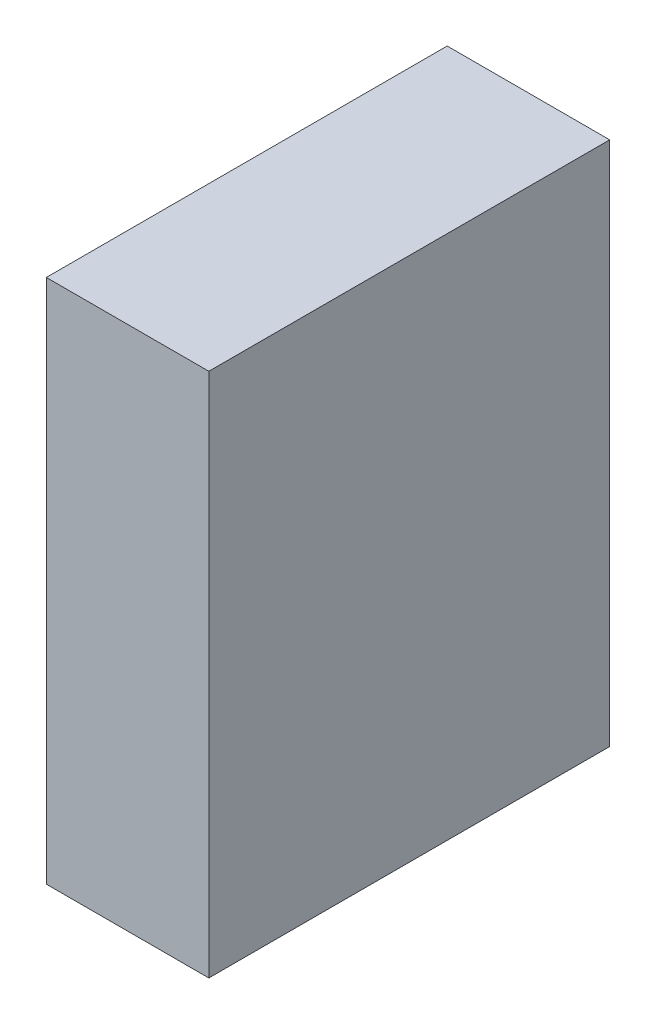
ISO-10303-21;
HEADER;
FILE_DESCRIPTION(('STEP AP214'),'2;1');
FILE_NAME('part.step','',(''),(''),'','','');
FILE_SCHEMA(('AUTOMOTIVE_DESIGN { 1 0 10303 214 1 1 1 1 }'));
ENDSEC;
DATA;
#1=APPLICATION_CONTEXT('core data for automotive mechanical design processes');
#2=APPLICATION_PROTOCOL_DEFINITION('international standard','automotive_design',2000,#1);
#3=PRODUCT_CONTEXT('',#1,'mechanical');
#4=PRODUCT('Part','Part','',(#3));
#5=PRODUCT_RELATED_PRODUCT_CATEGORY('part','',(#4));
#6=PRODUCT_DEFINITION_FORMATION('','',#4);
#7=PRODUCT_DEFINITION_CONTEXT('part definition',#1,'design');
#8=PRODUCT_DEFINITION('design','',#6,#7);
#9=PRODUCT_DEFINITION_SHAPE('','',#8);
#10=(LENGTH_UNIT() NAMED_UNIT(*) SI_UNIT(.MILLI.,.METRE.));
#11=(NAMED_UNIT(*) PLANE_ANGLE_UNIT() SI_UNIT($,.RADIAN.));
#12=(NAMED_UNIT(*) SI_UNIT($,.STERADIAN.) SOLID_ANGLE_UNIT());
#13=UNCERTAINTY_MEASURE_WITH_UNIT(LENGTH_MEASURE(1.E-05),#10,'distance_accuracy_value','');
#14=(GEOMETRIC_REPRESENTATION_CONTEXT(3) GLOBAL_UNCERTAINTY_ASSIGNED_CONTEXT((#13)) GLOBAL_UNIT_ASSIGNED_CONTEXT((#10,
#11,#12)) REPRESENTATION_CONTEXT('',''));
#15=CARTESIAN_POINT('',(0.,0.,0.));
#16=DIRECTION('',(0.,0.,1.));
#17=DIRECTION('',(1.,0.,0.));
#18=AXIS2_PLACEMENT_3D('',#15,#16,#17);
#19=CARTESIAN_POINT('',(30.,-48.5,-37.));
#20=DIRECTION('',(0.,0.,1.));
#21=DIRECTION('',(1.,0.,0.));
#22=AXIS2_PLACEMENT_3D('',#19,#20,#21);
#23=PLANE('',#22);
#24=DIRECTION('',(0.,1.,0.));
#25=VECTOR('',#24,1.);
#26=CARTESIAN_POINT('',(0.,-48.5,-37.));
#27=LINE('',#26,#25);
#28=CARTESIAN_POINT('',(0.,-48.5,-37.));
#29=VERTEX_POINT('',#28);
#30=CARTESIAN_POINT('',(0.,48.5,-37.));
#31=VERTEX_POINT('',#30);
#32=EDGE_CURVE('E95',#29,#31,#27,.T.);
#33=ORIENTED_EDGE('',*,*,#32,.T.);
#34=DIRECTION('',(-1.,0.,0.));
#35=VECTOR('',#34,1.);
#36=CARTESIAN_POINT('',(30.,48.5,-37.));
#37=LINE('',#36,#35);
#38=CARTESIAN_POINT('',(30.,48.5,-37.));
#39=VERTEX_POINT('',#38);
#40=EDGE_CURVE('E11',#39,#31,#37,.T.);
#41=ORIENTED_EDGE('',*,*,#40,.F.);
#42=DIRECTION('',(0.,1.,0.));
#43=VECTOR('',#42,1.);
#44=CARTESIAN_POINT('',(30.,-48.5,-37.));
#45=LINE('',#44,#43);
#46=CARTESIAN_POINT('',(30.,-48.5,-37.));
#47=VERTEX_POINT('',#46);
#48=EDGE_CURVE('E83',#47,#39,#45,.T.);
#49=ORIENTED_EDGE('',*,*,#48,.F.);
#50=DIRECTION('',(-1.,0.,0.));
#51=VECTOR('',#50,1.);
#52=CARTESIAN_POINT('',(30.,-48.5,-37.));
#53=LINE('',#52,#51);
#54=EDGE_CURVE('E91',#47,#29,#53,.T.);
#55=ORIENTED_EDGE('',*,*,#54,.T.);
#56=EDGE_LOOP('',(#33,#41,#49,#55));
#57=FACE_BOUND('',#56,.T.);
#58=ADVANCED_FACE('F32',(#57),#23,.F.);
#59=CARTESIAN_POINT('',(30.,48.5,37.));
#60=DIRECTION('',(0.,-1.,0.));
#61=DIRECTION('',(0.,0.,-1.));
#62=AXIS2_PLACEMENT_3D('',#59,#60,#61);
#63=PLANE('',#62);
#64=DIRECTION('',(0.,0.,1.));
#65=VECTOR('',#64,1.);
#66=CARTESIAN_POINT('',(0.,48.5,37.));
#67=LINE('',#66,#65);
#68=CARTESIAN_POINT('',(0.,48.5,37.));
#69=VERTEX_POINT('',#68);
#70=EDGE_CURVE('E87',#31,#69,#67,.T.);
#71=ORIENTED_EDGE('',*,*,#70,.T.);
#72=DIRECTION('',(-1.,0.,0.));
#73=VECTOR('',#72,1.);
#74=CARTESIAN_POINT('',(30.,48.5,37.));
#75=LINE('',#74,#73);
#76=CARTESIAN_POINT('',(30.,48.5,37.));
#77=VERTEX_POINT('',#76);
#78=EDGE_CURVE('E40',#77,#69,#75,.T.);
#79=ORIENTED_EDGE('',*,*,#78,.F.);
#80=DIRECTION('',(0.,0.,1.));
#81=VECTOR('',#80,1.);
#82=CARTESIAN_POINT('',(30.,48.5,37.));
#83=LINE('',#82,#81);
#84=EDGE_CURVE('E78',#39,#77,#83,.T.);
#85=ORIENTED_EDGE('',*,*,#84,.F.);
#86=ORIENTED_EDGE('',*,*,#40,.T.);
#87=EDGE_LOOP('',(#71,#79,#85,#86));
#88=FACE_BOUND('',#87,.T.);
#89=ADVANCED_FACE('F86',(#88),#63,.F.);
#90=CARTESIAN_POINT('',(30.,-48.5,37.));
#91=DIRECTION('',(0.,0.,-1.));
#92=DIRECTION('',(-1.,0.,0.));
#93=AXIS2_PLACEMENT_3D('',#90,#91,#92);
#94=PLANE('',#93);
#95=DIRECTION('',(0.,-1.,0.));
#96=VECTOR('',#95,1.);
#97=CARTESIAN_POINT('',(0.,-48.5,37.));
#98=LINE('',#97,#96);
#99=CARTESIAN_POINT('',(0.,-48.5,37.));
#100=VERTEX_POINT('',#99);
#101=EDGE_CURVE('E65',#69,#100,#98,.T.);
#102=ORIENTED_EDGE('',*,*,#101,.T.);
#103=DIRECTION('',(-1.,0.,0.));
#104=VECTOR('',#103,1.);
#105=CARTESIAN_POINT('',(30.,-48.5,37.));
#106=LINE('',#105,#104);
#107=CARTESIAN_POINT('',(30.,-48.5,37.));
#108=VERTEX_POINT('',#107);
#109=EDGE_CURVE('E88',#108,#100,#106,.T.);
#110=ORIENTED_EDGE('',*,*,#109,.F.);
#111=DIRECTION('',(0.,-1.,0.));
#112=VECTOR('',#111,1.);
#113=CARTESIAN_POINT('',(30.,-48.5,37.));
#114=LINE('',#113,#112);
#115=EDGE_CURVE('E81',#77,#108,#114,.T.);
#116=ORIENTED_EDGE('',*,*,#115,.F.);
#117=ORIENTED_EDGE('',*,*,#78,.T.);
#118=EDGE_LOOP('',(#102,#110,#116,#117));
#119=FACE_BOUND('',#118,.T.);
#120=ADVANCED_FACE('F89',(#119),#94,.F.);
#121=CARTESIAN_POINT('',(30.,-48.5,37.));
#122=DIRECTION('',(0.,1.,0.));
#123=DIRECTION('',(0.,0.,1.));
#124=AXIS2_PLACEMENT_3D('',#121,#122,#123);
#125=PLANE('',#124);
#126=DIRECTION('',(0.,0.,-1.));
#127=VECTOR('',#126,1.);
#128=CARTESIAN_POINT('',(0.,-48.5,37.));
#129=LINE('',#128,#127);
#130=EDGE_CURVE('E71',#100,#29,#129,.T.);
#131=ORIENTED_EDGE('',*,*,#130,.T.);
#132=ORIENTED_EDGE('',*,*,#54,.F.);
#133=DIRECTION('',(0.,0.,-1.));
#134=VECTOR('',#133,1.);
#135=CARTESIAN_POINT('',(30.,-48.5,37.));
#136=LINE('',#135,#134);
#137=EDGE_CURVE('E48',#108,#47,#136,.T.);
#138=ORIENTED_EDGE('',*,*,#137,.F.);
#139=ORIENTED_EDGE('',*,*,#109,.T.);
#140=EDGE_LOOP('',(#131,#132,#138,#139));
#141=FACE_BOUND('',#140,.T.);
#142=ADVANCED_FACE('F102',(#141),#125,.F.);
#143=CARTESIAN_POINT('',(30.,0.,0.));
#144=DIRECTION('',(-1.,0.,0.));
#145=DIRECTION('',(0.,0.,1.));
#146=AXIS2_PLACEMENT_3D('',#143,#144,#145);
#147=PLANE('',#146);
#148=ORIENTED_EDGE('',*,*,#48,.T.);
#149=ORIENTED_EDGE('',*,*,#84,.T.);
#150=ORIENTED_EDGE('',*,*,#115,.T.);
#151=ORIENTED_EDGE('',*,*,#137,.T.);
#152=EDGE_LOOP('',(#148,#149,#150,#151));
#153=FACE_BOUND('',#152,.T.);
#154=ADVANCED_FACE('F79',(#153),#147,.F.);
#155=CARTESIAN_POINT('',(0.,0.,0.));
#156=DIRECTION('',(-1.,0.,0.));
#157=DIRECTION('',(0.,0.,1.));
#158=AXIS2_PLACEMENT_3D('',#155,#156,#157);
#159=PLANE('',#158);
#160=ORIENTED_EDGE('',*,*,#32,.F.);
#161=ORIENTED_EDGE('',*,*,#130,.F.);
#162=ORIENTED_EDGE('',*,*,#101,.F.);
#163=ORIENTED_EDGE('',*,*,#70,.F.);
#164=EDGE_LOOP('',(#160,#161,#162,#163));
#165=FACE_BOUND('',#164,.T.);
#166=ADVANCED_FACE('F105',(#165),#159,.T.);
#167=CLOSED_SHELL('',(#58,#89,#120,#142,#154,#166));
#168=MANIFOLD_SOLID_BREP('B2',#167);
#169=ADVANCED_BREP_SHAPE_REPRESENTATION('',(#18,#168),#14);
#170=SHAPE_DEFINITION_REPRESENTATION(#9,#169);
ENDSEC;
END-ISO-10303-21;
